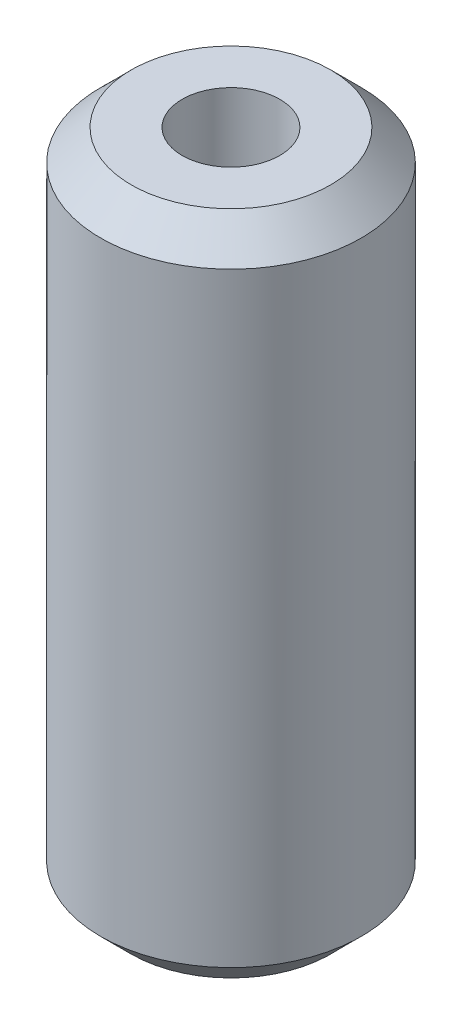
ISO-10303-21;
HEADER;
FILE_DESCRIPTION(('STEP AP214'),'2;1');
FILE_NAME('part.step','',(''),(''),'','','');
FILE_SCHEMA(('AUTOMOTIVE_DESIGN { 1 0 10303 214 1 1 1 1 }'));
ENDSEC;
DATA;
#1=APPLICATION_CONTEXT('core data for automotive mechanical design processes');
#2=APPLICATION_PROTOCOL_DEFINITION('international standard','automotive_design',2000,#1);
#3=PRODUCT_CONTEXT('',#1,'mechanical');
#4=PRODUCT('Part','Part','',(#3));
#5=PRODUCT_RELATED_PRODUCT_CATEGORY('part','',(#4));
#6=PRODUCT_DEFINITION_FORMATION('','',#4);
#7=PRODUCT_DEFINITION_CONTEXT('part definition',#1,'design');
#8=PRODUCT_DEFINITION('design','',#6,#7);
#9=PRODUCT_DEFINITION_SHAPE('','',#8);
#10=(LENGTH_UNIT() NAMED_UNIT(*) SI_UNIT(.MILLI.,.METRE.));
#11=(NAMED_UNIT(*) PLANE_ANGLE_UNIT() SI_UNIT($,.RADIAN.));
#12=(NAMED_UNIT(*) SI_UNIT($,.STERADIAN.) SOLID_ANGLE_UNIT());
#13=UNCERTAINTY_MEASURE_WITH_UNIT(LENGTH_MEASURE(1.E-05),#10,'distance_accuracy_value','');
#14=(GEOMETRIC_REPRESENTATION_CONTEXT(3) GLOBAL_UNCERTAINTY_ASSIGNED_CONTEXT((#13)) GLOBAL_UNIT_ASSIGNED_CONTEXT((#10,
#11,#12)) REPRESENTATION_CONTEXT('',''));
#15=CARTESIAN_POINT('',(0.,0.,0.));
#16=DIRECTION('',(0.,0.,1.));
#17=DIRECTION('',(1.,0.,0.));
#18=AXIS2_PLACEMENT_3D('',#15,#16,#17);
#19=CARTESIAN_POINT('',(0.,127.759392534857,0.));
#20=DIRECTION('',(0.,-1.,0.));
#21=DIRECTION('',(0.,0.,-1.));
#22=AXIS2_PLACEMENT_3D('',#19,#20,#21);
#23=CYLINDRICAL_SURFACE('',#22,25.);
#24=CARTESIAN_POINT('',(0.,121.878745050005,0.));
#25=DIRECTION('',(0.,1.,0.));
#26=DIRECTION('',(0.,0.,1.));
#27=AXIS2_PLACEMENT_3D('',#24,#25,#26);
#28=CIRCLE('',#27,25.);
#29=CARTESIAN_POINT('',(0.,121.878745050005,-25.));
#30=VERTEX_POINT('',#29);
#31=EDGE_CURVE('E50',#30,#30,#28,.F.);
#32=ORIENTED_EDGE('',*,*,#31,.T.);
#33=EDGE_LOOP('',(#32));
#34=FACE_BOUND('',#33,.T.);
#35=CARTESIAN_POINT('',(0.,5.88064748485237,0.));
#36=DIRECTION('',(0.,1.,0.));
#37=DIRECTION('',(0.,0.,1.));
#38=AXIS2_PLACEMENT_3D('',#35,#36,#37);
#39=CIRCLE('',#38,25.);
#40=CARTESIAN_POINT('',(0.,5.88064748485237,25.));
#41=VERTEX_POINT('',#40);
#42=EDGE_CURVE('E51',#41,#41,#39,.T.);
#43=ORIENTED_EDGE('',*,*,#42,.T.);
#44=EDGE_LOOP('',(#43));
#45=FACE_BOUND('',#44,.T.);
#46=ADVANCED_FACE('F39',(#34,#45),#23,.T.);
#47=CARTESIAN_POINT('',(0.,127.759392534857,0.));
#48=DIRECTION('',(0.,1.,0.));
#49=DIRECTION('',(0.,0.,1.));
#50=AXIS2_PLACEMENT_3D('',#47,#48,#49);
#51=PLANE('',#50);
#52=CARTESIAN_POINT('',(0.,127.759392534857,0.));
#53=DIRECTION('',(0.,1.,0.));
#54=DIRECTION('',(0.,0.,1.));
#55=AXIS2_PLACEMENT_3D('',#52,#53,#54);
#56=CIRCLE('',#55,19.1193525151477);
#57=CARTESIAN_POINT('',(0.,127.759392534857,-19.1193525151477));
#58=VERTEX_POINT('',#57);
#59=EDGE_CURVE('E54',#58,#58,#56,.T.);
#60=ORIENTED_EDGE('',*,*,#59,.T.);
#61=EDGE_LOOP('',(#60));
#62=FACE_BOUND('',#61,.T.);
#63=CARTESIAN_POINT('',(0.,127.759392534857,0.));
#64=DIRECTION('',(0.,1.,0.));
#65=DIRECTION('',(0.,0.,1.));
#66=AXIS2_PLACEMENT_3D('',#63,#64,#65);
#67=CIRCLE('',#66,9.35542691558549);
#68=CARTESIAN_POINT('',(0.,127.759392534857,9.35542691558549));
#69=VERTEX_POINT('',#68);
#70=EDGE_CURVE('E58',#69,#69,#67,.T.);
#71=ORIENTED_EDGE('',*,*,#70,.F.);
#72=EDGE_LOOP('',(#71));
#73=FACE_BOUND('',#72,.T.);
#74=ADVANCED_FACE('F69',(#62,#73),#51,.T.);
#75=CARTESIAN_POINT('',(0.,0.,0.));
#76=DIRECTION('',(0.,1.,0.));
#77=DIRECTION('',(0.,0.,1.));
#78=AXIS2_PLACEMENT_3D('',#75,#76,#77);
#79=PLANE('',#78);
#80=CARTESIAN_POINT('',(0.,0.,0.));
#81=DIRECTION('',(0.,1.,0.));
#82=DIRECTION('',(0.,0.,1.));
#83=AXIS2_PLACEMENT_3D('',#80,#81,#82);
#84=CIRCLE('',#83,19.1193525151476);
#85=CARTESIAN_POINT('',(0.,0.,19.1193525151476));
#86=VERTEX_POINT('',#85);
#87=EDGE_CURVE('E10',#86,#86,#84,.F.);
#88=ORIENTED_EDGE('',*,*,#87,.T.);
#89=EDGE_LOOP('',(#88));
#90=FACE_BOUND('',#89,.T.);
#91=CARTESIAN_POINT('',(0.,0.,0.));
#92=DIRECTION('',(0.,1.,0.));
#93=DIRECTION('',(0.,0.,1.));
#94=AXIS2_PLACEMENT_3D('',#91,#92,#93);
#95=CIRCLE('',#94,9.35542691558549);
#96=CARTESIAN_POINT('',(0.,0.,9.35542691558549));
#97=VERTEX_POINT('',#96);
#98=EDGE_CURVE('E63',#97,#97,#95,.T.);
#99=ORIENTED_EDGE('',*,*,#98,.T.);
#100=EDGE_LOOP('',(#99));
#101=FACE_BOUND('',#100,.T.);
#102=ADVANCED_FACE('F75',(#90,#101),#79,.F.);
#103=CARTESIAN_POINT('',(0.,127.759392534857,0.));
#104=DIRECTION('',(0.,-1.,0.));
#105=DIRECTION('',(0.,0.,-1.));
#106=AXIS2_PLACEMENT_3D('',#103,#104,#105);
#107=CYLINDRICAL_SURFACE('',#106,9.35542691558549);
#108=ORIENTED_EDGE('',*,*,#70,.T.);
#109=EDGE_LOOP('',(#108));
#110=FACE_BOUND('',#109,.T.);
#111=ORIENTED_EDGE('',*,*,#98,.F.);
#112=EDGE_LOOP('',(#111));
#113=FACE_BOUND('',#112,.T.);
#114=ADVANCED_FACE('F70',(#110,#113),#107,.F.);
#115=CARTESIAN_POINT('',(0.,127.759392534857,0.));
#116=DIRECTION('',(0.,-1.,0.));
#117=DIRECTION('',(0.,0.,-1.));
#118=AXIS2_PLACEMENT_3D('',#115,#116,#117);
#119=CONICAL_SURFACE('',#118,19.1193525151477,0.785398163397443);
#120=CARTESIAN_POINT('',(0.,121.878745050005,-25.));
#121=CARTESIAN_POINT('',(0.,121.940001794639,-24.9387432553661));
#122=CARTESIAN_POINT('',(0.,122.001258539273,-24.8774865107323));
#123=CARTESIAN_POINT('',(0.,122.12377202854,-24.7549730214645));
#124=CARTESIAN_POINT('',(0.,122.185028773174,-24.6937162768306));
#125=CARTESIAN_POINT('',(0.,122.307542262442,-24.5712027875629));
#126=CARTESIAN_POINT('',(0.,122.368799007076,-24.509946042929));
#127=CARTESIAN_POINT('',(0.,122.491312496344,-24.3874325536612));
#128=CARTESIAN_POINT('',(0.,122.552569240978,-24.3261758090273));
#129=CARTESIAN_POINT('',(0.,122.675082730245,-24.2036623197596));
#130=CARTESIAN_POINT('',(0.,122.736339474879,-24.1424055751257));
#131=CARTESIAN_POINT('',(0.,122.858852964147,-24.019892085858));
#132=CARTESIAN_POINT('',(0.,122.920109708781,-23.9586353412241));
#133=CARTESIAN_POINT('',(0.,123.042623198049,-23.8361218519563));
#134=CARTESIAN_POINT('',(0.,123.103879942682,-23.7748651073224));
#135=CARTESIAN_POINT('',(0.,123.22639343195,-23.6523516180547));
#136=CARTESIAN_POINT('',(0.,123.287650176584,-23.5910948734208));
#137=CARTESIAN_POINT('',(0.,123.410163665852,-23.468581384153));
#138=CARTESIAN_POINT('',(0.,123.471420410486,-23.4073246395192));
#139=CARTESIAN_POINT('',(0.,123.593933899754,-23.2848111502514));
#140=CARTESIAN_POINT('',(0.,123.655190644387,-23.2235544056175));
#141=CARTESIAN_POINT('',(0.,123.777704133655,-23.1010409163498));
#142=CARTESIAN_POINT('',(0.,123.838960878289,-23.0397841717159));
#143=CARTESIAN_POINT('',(0.,123.961474367557,-22.9172706824481));
#144=CARTESIAN_POINT('',(0.,124.022731112191,-22.8560139378143));
#145=CARTESIAN_POINT('',(0.,124.145244601458,-22.7335004485465));
#146=CARTESIAN_POINT('',(0.,124.206501346092,-22.6722437039126));
#147=CARTESIAN_POINT('',(0.,124.32901483536,-22.5497302146449));
#148=CARTESIAN_POINT('',(0.,124.390271579994,-22.488473470011));
#149=CARTESIAN_POINT('',(0.,124.512785069262,-22.3659599807432));
#150=CARTESIAN_POINT('',(0.,124.574041813896,-22.3047032361094));
#151=CARTESIAN_POINT('',(0.,124.696555303163,-22.1821897468416));
#152=CARTESIAN_POINT('',(0.,124.757812047797,-22.1209330022077));
#153=CARTESIAN_POINT('',(0.,124.880325537065,-21.99841951294));
#154=CARTESIAN_POINT('',(0.,124.941582281699,-21.9371627683061));
#155=CARTESIAN_POINT('',(0.,125.064095770967,-21.8146492790383));
#156=CARTESIAN_POINT('',(0.,125.1253525156,-21.7533925344045));
#157=CARTESIAN_POINT('',(0.,125.247866004868,-21.6308790451367));
#158=CARTESIAN_POINT('',(0.,125.309122749502,-21.5696223005028));
#159=CARTESIAN_POINT('',(0.,125.43163623877,-21.4471088112351));
#160=CARTESIAN_POINT('',(0.,125.492892983404,-21.3858520666012));
#161=CARTESIAN_POINT('',(0.,125.615406472672,-21.2633385773334));
#162=CARTESIAN_POINT('',(0.,125.676663217305,-21.2020818326995));
#163=CARTESIAN_POINT('',(0.,125.799176706573,-21.0795683434318));
#164=CARTESIAN_POINT('',(0.,125.860433451207,-21.0183115987979));
#165=CARTESIAN_POINT('',(0.,125.982946940475,-20.8957981095301));
#166=CARTESIAN_POINT('',(0.,126.044203685109,-20.8345413648963));
#167=CARTESIAN_POINT('',(0.,126.166717174376,-20.7120278756285));
#168=CARTESIAN_POINT('',(0.,126.22797391901,-20.6507711309946));
#169=CARTESIAN_POINT('',(0.,126.350487408278,-20.5282576417269));
#170=CARTESIAN_POINT('',(0.,126.411744152912,-20.467000897093));
#171=CARTESIAN_POINT('',(0.,126.53425764218,-20.3444874078252));
#172=CARTESIAN_POINT('',(0.,126.595514386814,-20.2832306631914));
#173=CARTESIAN_POINT('',(0.,126.718027876081,-20.1607171739236));
#174=CARTESIAN_POINT('',(0.,126.779284620715,-20.0994604292897));
#175=CARTESIAN_POINT('',(0.,126.901798109983,-19.976946940022));
#176=CARTESIAN_POINT('',(0.,126.963054854617,-19.9156901953881));
#177=CARTESIAN_POINT('',(0.,127.085568343885,-19.7931767061203));
#178=CARTESIAN_POINT('',(0.,127.146825088519,-19.7319199614865));
#179=CARTESIAN_POINT('',(0.,127.269338577786,-19.6094064722187));
#180=CARTESIAN_POINT('',(0.,127.33059532242,-19.5481497275848));
#181=CARTESIAN_POINT('',(0.,127.453108811688,-19.4256362383171));
#182=CARTESIAN_POINT('',(0.,127.514365556322,-19.3643794936832));
#183=CARTESIAN_POINT('',(0.,127.63687904559,-19.2418660044154));
#184=CARTESIAN_POINT('',(0.,127.698135790223,-19.1806092597816));
#185=CARTESIAN_POINT('',(0.,127.759392534857,-19.1193525151477));
#186=B_SPLINE_CURVE_WITH_KNOTS('',3,(#120,#121,#122,#123,#124,#125,#126,#127,#128,#129,#130,
#131,#132,#133,#134,#135,#136,#137,#138,#139,#140,#141,#142,#143,#144,#145,#146,#147,#148,#149,
#150,#151,#152,#153,#154,#155,#156,#157,#158,#159,#160,#161,#162,#163,#164,#165,#166,#167,#168,
#169,#170,#171,#172,#173,#174,#175,#176,#177,#178,#179,#180,#181,#182,#183,#184,#185),
.UNSPECIFIED.,.F.,.F.,(4,2,2,2,2,2,2,2,2,2,2,2,2,2,2,2,2,2,2,2,2,2,2,2,2,2,2,2,2,2,2,2,4),(0.,
0.259890357144167,0.519780714288336,0.779671071432502,1.03956142857668,1.29945178572085,
1.55934214286502,1.81923250000918,2.07912285715336,2.33901321429753,2.5989035714417,
2.85879392858587,3.11868428573004,3.37857464287421,3.63846500001838,3.89835535716256,
4.15824571430672,4.41813607145089,4.67802642859507,4.93791678573923,5.1978071428834,
5.45769750002758,5.71758785717174,5.97747821431592,6.23736857146008,6.49725892860426,
6.75714928574843,7.01703964289259,7.27693000003677,7.53682035718095,7.7967107143251,
8.05660107146928,8.31649142861346),.UNSPECIFIED.);
#187=EDGE_CURVE('BSEAM81',#30,#58,#186,.T.);
#188=ORIENTED_EDGE('',*,*,#31,.F.);
#189=ORIENTED_EDGE('',*,*,#59,.F.);
#190=ORIENTED_EDGE('',*,*,#187,.T.);
#191=ORIENTED_EDGE('',*,*,#187,.F.);
#192=EDGE_LOOP('',(#188,#190,#189,#191));
#193=FACE_BOUND('',#192,.T.);
#194=ADVANCED_FACE('F81',(#193),#119,.T.);
#195=CARTESIAN_POINT('',(0.,5.88064748485237,0.));
#196=DIRECTION('',(0.,1.,0.));
#197=DIRECTION('',(0.,0.,1.));
#198=AXIS2_PLACEMENT_3D('',#195,#196,#197);
#199=CONICAL_SURFACE('',#198,25.,0.785398163397452);
#200=ORIENTED_EDGE('',*,*,#87,.F.);
#201=EDGE_LOOP('',(#200));
#202=FACE_BOUND('',#201,.T.);
#203=ORIENTED_EDGE('',*,*,#42,.F.);
#204=EDGE_LOOP('',(#203));
#205=FACE_BOUND('',#204,.T.);
#206=ADVANCED_FACE('F45',(#202,#205),#199,.T.);
#207=CLOSED_SHELL('',(#46,#74,#102,#114,#194,#206));
#208=MANIFOLD_SOLID_BREP('B2',#207);
#209=ADVANCED_BREP_SHAPE_REPRESENTATION('',(#18,#208),#14);
#210=SHAPE_DEFINITION_REPRESENTATION(#9,#209);
ENDSEC;
END-ISO-10303-21;
